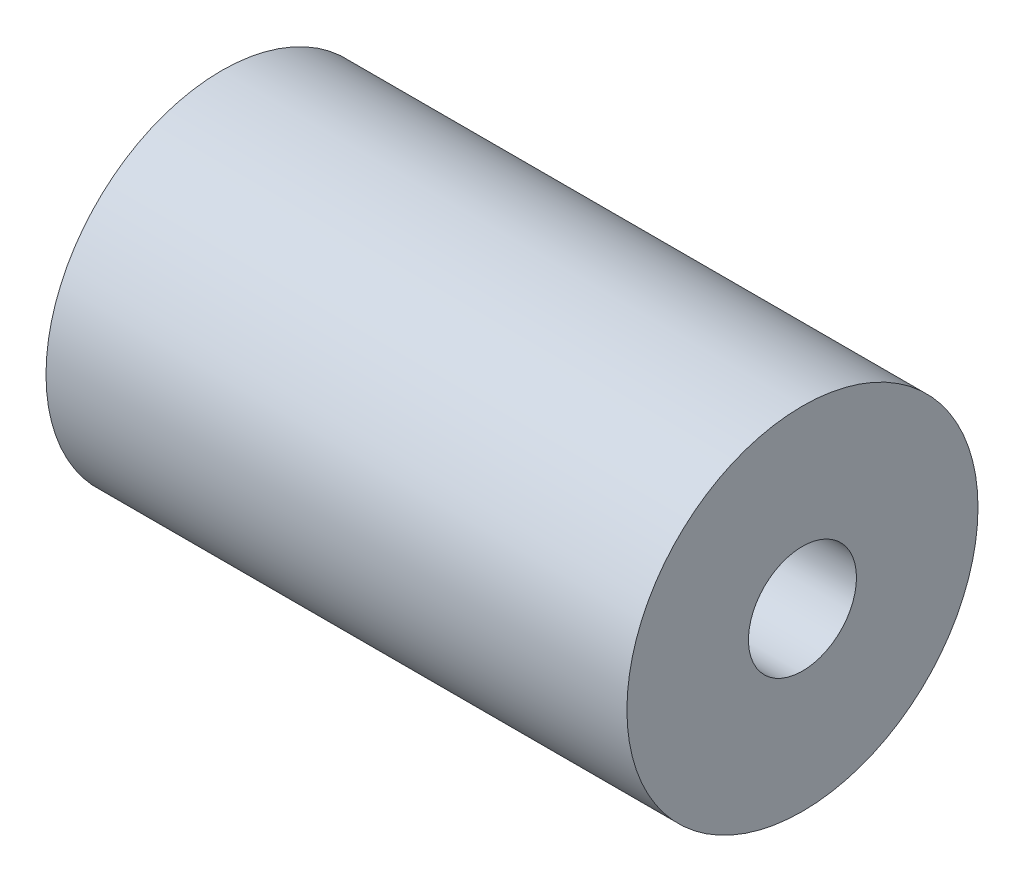
ISO-10303-21;
HEADER;
FILE_DESCRIPTION(('STEP AP214'),'2;1');
FILE_NAME('part.step','',(''),(''),'','','');
FILE_SCHEMA(('AUTOMOTIVE_DESIGN { 1 0 10303 214 1 1 1 1 }'));
ENDSEC;
DATA;
#1=APPLICATION_CONTEXT('core data for automotive mechanical design processes');
#2=APPLICATION_PROTOCOL_DEFINITION('international standard','automotive_design',2000,#1);
#3=PRODUCT_CONTEXT('',#1,'mechanical');
#4=PRODUCT('Part','Part','',(#3));
#5=PRODUCT_RELATED_PRODUCT_CATEGORY('part','',(#4));
#6=PRODUCT_DEFINITION_FORMATION('','',#4);
#7=PRODUCT_DEFINITION_CONTEXT('part definition',#1,'design');
#8=PRODUCT_DEFINITION('design','',#6,#7);
#9=PRODUCT_DEFINITION_SHAPE('','',#8);
#10=(LENGTH_UNIT() NAMED_UNIT(*) SI_UNIT(.MILLI.,.METRE.));
#11=(NAMED_UNIT(*) PLANE_ANGLE_UNIT() SI_UNIT($,.RADIAN.));
#12=(NAMED_UNIT(*) SI_UNIT($,.STERADIAN.) SOLID_ANGLE_UNIT());
#13=UNCERTAINTY_MEASURE_WITH_UNIT(LENGTH_MEASURE(1.E-05),#10,'distance_accuracy_value','');
#14=(GEOMETRIC_REPRESENTATION_CONTEXT(3) GLOBAL_UNCERTAINTY_ASSIGNED_CONTEXT((#13)) GLOBAL_UNIT_ASSIGNED_CONTEXT((#10,
#11,#12)) REPRESENTATION_CONTEXT('',''));
#15=CARTESIAN_POINT('',(0.,0.,0.));
#16=DIRECTION('',(0.,0.,1.));
#17=DIRECTION('',(1.,0.,0.));
#18=AXIS2_PLACEMENT_3D('',#15,#16,#17);
#19=CARTESIAN_POINT('',(21.51,0.,0.));
#20=DIRECTION('',(1.,0.,0.));
#21=DIRECTION('',(0.,0.,-1.));
#22=AXIS2_PLACEMENT_3D('',#19,#20,#21);
#23=PLANE('',#22);
#24=CARTESIAN_POINT('',(21.51,0.,0.));
#25=DIRECTION('',(1.,0.,0.));
#26=DIRECTION('',(0.,0.,-1.));
#27=AXIS2_PLACEMENT_3D('',#24,#25,#26);
#28=CIRCLE('',#27,6.5);
#29=CARTESIAN_POINT('',(21.51,0.,-6.5));
#30=VERTEX_POINT('',#29);
#31=EDGE_CURVE('E10',#30,#30,#28,.T.);
#32=ORIENTED_EDGE('',*,*,#31,.T.);
#33=EDGE_LOOP('',(#32));
#34=FACE_BOUND('',#33,.T.);
#35=CARTESIAN_POINT('',(21.51,0.,0.));
#36=DIRECTION('',(1.,0.,0.));
#37=DIRECTION('',(0.,0.,-1.));
#38=AXIS2_PLACEMENT_3D('',#35,#36,#37);
#39=CIRCLE('',#38,2.);
#40=CARTESIAN_POINT('',(21.51,0.,-2.));
#41=VERTEX_POINT('',#40);
#42=EDGE_CURVE('E42',#41,#41,#39,.T.);
#43=ORIENTED_EDGE('',*,*,#42,.F.);
#44=EDGE_LOOP('',(#43));
#45=FACE_BOUND('',#44,.T.);
#46=ADVANCED_FACE('F31',(#34,#45),#23,.T.);
#47=CARTESIAN_POINT('',(0.,0.,0.));
#48=DIRECTION('',(1.,0.,0.));
#49=DIRECTION('',(0.,0.,-1.));
#50=AXIS2_PLACEMENT_3D('',#47,#48,#49);
#51=PLANE('',#50);
#52=CARTESIAN_POINT('',(0.,0.,0.));
#53=DIRECTION('',(1.,0.,0.));
#54=DIRECTION('',(0.,0.,-1.));
#55=AXIS2_PLACEMENT_3D('',#52,#53,#54);
#56=CIRCLE('',#55,6.5);
#57=CARTESIAN_POINT('',(0.,0.,-6.5));
#58=VERTEX_POINT('',#57);
#59=EDGE_CURVE('E35',#58,#58,#56,.T.);
#60=ORIENTED_EDGE('',*,*,#59,.F.);
#61=EDGE_LOOP('',(#60));
#62=FACE_BOUND('',#61,.T.);
#63=CARTESIAN_POINT('',(0.,0.,0.));
#64=DIRECTION('',(1.,0.,0.));
#65=DIRECTION('',(0.,0.,-1.));
#66=AXIS2_PLACEMENT_3D('',#63,#64,#65);
#67=CIRCLE('',#66,2.);
#68=CARTESIAN_POINT('',(0.,0.,-2.));
#69=VERTEX_POINT('',#68);
#70=EDGE_CURVE('E44',#69,#69,#67,.T.);
#71=ORIENTED_EDGE('',*,*,#70,.T.);
#72=EDGE_LOOP('',(#71));
#73=FACE_BOUND('',#72,.T.);
#74=ADVANCED_FACE('F54',(#62,#73),#51,.F.);
#75=CARTESIAN_POINT('',(21.51,0.,0.));
#76=DIRECTION('',(-1.,0.,0.));
#77=DIRECTION('',(0.,0.,1.));
#78=AXIS2_PLACEMENT_3D('',#75,#76,#77);
#79=CYLINDRICAL_SURFACE('',#78,6.5);
#80=ORIENTED_EDGE('',*,*,#31,.F.);
#81=EDGE_LOOP('',(#80));
#82=FACE_BOUND('',#81,.T.);
#83=ORIENTED_EDGE('',*,*,#59,.T.);
#84=EDGE_LOOP('',(#83));
#85=FACE_BOUND('',#84,.T.);
#86=ADVANCED_FACE('F33',(#82,#85),#79,.T.);
#87=CARTESIAN_POINT('',(21.51,0.,0.));
#88=DIRECTION('',(-1.,0.,0.));
#89=DIRECTION('',(0.,0.,1.));
#90=AXIS2_PLACEMENT_3D('',#87,#88,#89);
#91=CYLINDRICAL_SURFACE('',#90,2.);
#92=ORIENTED_EDGE('',*,*,#42,.T.);
#93=EDGE_LOOP('',(#92));
#94=FACE_BOUND('',#93,.T.);
#95=ORIENTED_EDGE('',*,*,#70,.F.);
#96=EDGE_LOOP('',(#95));
#97=FACE_BOUND('',#96,.T.);
#98=ADVANCED_FACE('F50',(#94,#97),#91,.F.);
#99=CLOSED_SHELL('',(#46,#74,#86,#98));
#100=MANIFOLD_SOLID_BREP('B2',#99);
#101=ADVANCED_BREP_SHAPE_REPRESENTATION('',(#18,#100),#14);
#102=SHAPE_DEFINITION_REPRESENTATION(#9,#101);
ENDSEC;
END-ISO-10303-21;
